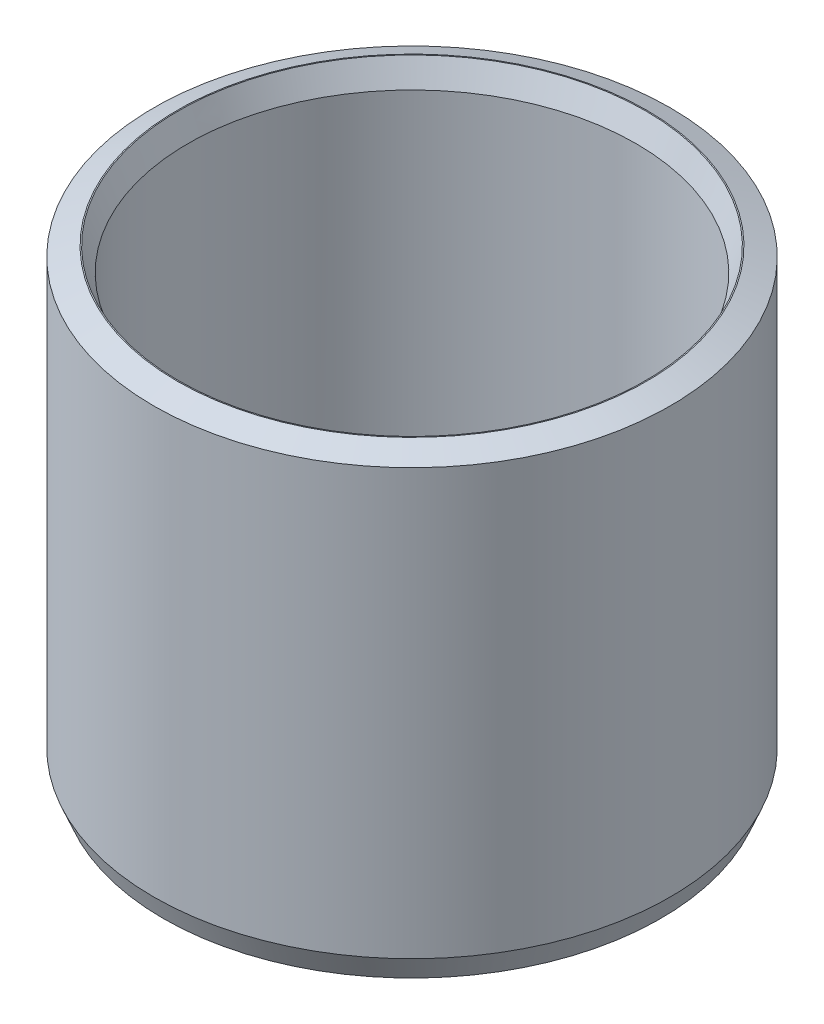
ISO-10303-21;
HEADER;
FILE_DESCRIPTION(('STEP AP214'),'2;1');
FILE_NAME('part.step','',(''),(''),'','','');
FILE_SCHEMA(('AUTOMOTIVE_DESIGN { 1 0 10303 214 1 1 1 1 }'));
ENDSEC;
DATA;
#1=APPLICATION_CONTEXT('core data for automotive mechanical design processes');
#2=APPLICATION_PROTOCOL_DEFINITION('international standard','automotive_design',2000,#1);
#3=PRODUCT_CONTEXT('',#1,'mechanical');
#4=PRODUCT('Part','Part','',(#3));
#5=PRODUCT_RELATED_PRODUCT_CATEGORY('part','',(#4));
#6=PRODUCT_DEFINITION_FORMATION('','',#4);
#7=PRODUCT_DEFINITION_CONTEXT('part definition',#1,'design');
#8=PRODUCT_DEFINITION('design','',#6,#7);
#9=PRODUCT_DEFINITION_SHAPE('','',#8);
#10=(LENGTH_UNIT() NAMED_UNIT(*) SI_UNIT(.MILLI.,.METRE.));
#11=(NAMED_UNIT(*) PLANE_ANGLE_UNIT() SI_UNIT($,.RADIAN.));
#12=(NAMED_UNIT(*) SI_UNIT($,.STERADIAN.) SOLID_ANGLE_UNIT());
#13=UNCERTAINTY_MEASURE_WITH_UNIT(LENGTH_MEASURE(1.E-05),#10,'distance_accuracy_value','');
#14=(GEOMETRIC_REPRESENTATION_CONTEXT(3) GLOBAL_UNCERTAINTY_ASSIGNED_CONTEXT((#13)) GLOBAL_UNIT_ASSIGNED_CONTEXT((#10,
#11,#12)) REPRESENTATION_CONTEXT('',''));
#15=CARTESIAN_POINT('',(0.,0.,0.));
#16=DIRECTION('',(0.,0.,1.));
#17=DIRECTION('',(1.,0.,0.));
#18=AXIS2_PLACEMENT_3D('',#15,#16,#17);
#19=CARTESIAN_POINT('',(0.,75.435899167172,0.));
#20=DIRECTION('',(0.,-1.,0.));
#21=DIRECTION('',(0.,0.,-1.));
#22=AXIS2_PLACEMENT_3D('',#19,#20,#21);
#23=CYLINDRICAL_SURFACE('',#22,42.5);
#24=CARTESIAN_POINT('',(0.,3.86957310814552,0.));
#25=DIRECTION('',(0.,1.,0.));
#26=DIRECTION('',(0.,0.,1.));
#27=AXIS2_PLACEMENT_3D('',#24,#25,#26);
#28=CIRCLE('',#27,42.5);
#29=CARTESIAN_POINT('',(0.,3.86957310814551,-42.5));
#30=VERTEX_POINT('',#29);
#31=EDGE_CURVE('E10',#30,#30,#28,.T.);
#32=CARTESIAN_POINT('',(0.,73.8527801951656,0.));
#33=DIRECTION('',(0.,1.,0.));
#34=DIRECTION('',(0.,0.,1.));
#35=AXIS2_PLACEMENT_3D('',#32,#33,#34);
#36=CIRCLE('',#35,42.5);
#37=CARTESIAN_POINT('',(0.,73.8527801951656,-42.5));
#38=VERTEX_POINT('',#37);
#39=EDGE_CURVE('E50',#38,#38,#36,.F.);
#40=CARTESIAN_POINT('',(0.,3.86957310814551,-42.5));
#41=CARTESIAN_POINT('',(0.,4.5985648486353,-42.5));
#42=CARTESIAN_POINT('',(0.,5.32755658912509,-42.5));
#43=CARTESIAN_POINT('',(0.,6.78554007010468,-42.5));
#44=CARTESIAN_POINT('',(0.,7.51453181059447,-42.5));
#45=CARTESIAN_POINT('',(0.,8.97251529157406,-42.5));
#46=CARTESIAN_POINT('',(0.,9.70150703206385,-42.5));
#47=CARTESIAN_POINT('',(0.,11.1594905130434,-42.5));
#48=CARTESIAN_POINT('',(0.,11.8884822535332,-42.5));
#49=CARTESIAN_POINT('',(0.,13.3464657345128,-42.5));
#50=CARTESIAN_POINT('',(0.,14.0754574750026,-42.5));
#51=CARTESIAN_POINT('',(0.,15.5334409559822,-42.5));
#52=CARTESIAN_POINT('',(0.,16.262432696472,-42.5));
#53=CARTESIAN_POINT('',(0.,17.7204161774516,-42.5));
#54=CARTESIAN_POINT('',(0.,18.4494079179414,-42.5));
#55=CARTESIAN_POINT('',(0.,19.907391398921,-42.5));
#56=CARTESIAN_POINT('',(0.,20.6363831394107,-42.5));
#57=CARTESIAN_POINT('',(0.,22.0943666203903,-42.5));
#58=CARTESIAN_POINT('',(0.,22.8233583608801,-42.5));
#59=CARTESIAN_POINT('',(0.,24.2813418418597,-42.5));
#60=CARTESIAN_POINT('',(0.,25.0103335823495,-42.5));
#61=CARTESIAN_POINT('',(0.,26.4683170633291,-42.5));
#62=CARTESIAN_POINT('',(0.,27.1973088038189,-42.5));
#63=CARTESIAN_POINT('',(0.,28.6552922847985,-42.5));
#64=CARTESIAN_POINT('',(0.,29.3842840252883,-42.5));
#65=CARTESIAN_POINT('',(0.,30.8422675062678,-42.5));
#66=CARTESIAN_POINT('',(0.,31.5712592467576,-42.5));
#67=CARTESIAN_POINT('',(0.,33.0292427277372,-42.5));
#68=CARTESIAN_POINT('',(0.,33.758234468227,-42.5));
#69=CARTESIAN_POINT('',(0.,35.2162179492066,-42.5));
#70=CARTESIAN_POINT('',(0.,35.9452096896964,-42.5));
#71=CARTESIAN_POINT('',(0.,37.403193170676,-42.5));
#72=CARTESIAN_POINT('',(0.,38.1321849111658,-42.5));
#73=CARTESIAN_POINT('',(0.,39.5901683921454,-42.5));
#74=CARTESIAN_POINT('',(0.,40.3191601326352,-42.5));
#75=CARTESIAN_POINT('',(0.,41.7771436136147,-42.5));
#76=CARTESIAN_POINT('',(0.,42.5061353541045,-42.5));
#77=CARTESIAN_POINT('',(0.,43.9641188350841,-42.5));
#78=CARTESIAN_POINT('',(0.,44.6931105755739,-42.5));
#79=CARTESIAN_POINT('',(0.,46.1510940565535,-42.5));
#80=CARTESIAN_POINT('',(0.,46.8800857970433,-42.5));
#81=CARTESIAN_POINT('',(0.,48.3380692780229,-42.5));
#82=CARTESIAN_POINT('',(0.,49.0670610185127,-42.5));
#83=CARTESIAN_POINT('',(0.,50.5250444994923,-42.5));
#84=CARTESIAN_POINT('',(0.,51.254036239982,-42.5));
#85=CARTESIAN_POINT('',(0.,52.7120197209616,-42.5));
#86=CARTESIAN_POINT('',(0.,53.4410114614514,-42.5));
#87=CARTESIAN_POINT('',(0.,54.898994942431,-42.5));
#88=CARTESIAN_POINT('',(0.,55.6279866829208,-42.5));
#89=CARTESIAN_POINT('',(0.,57.0859701639004,-42.5));
#90=CARTESIAN_POINT('',(0.,57.8149619043902,-42.5));
#91=CARTESIAN_POINT('',(0.,59.2729453853698,-42.5));
#92=CARTESIAN_POINT('',(0.,60.0019371258596,-42.5));
#93=CARTESIAN_POINT('',(0.,61.4599206068391,-42.5));
#94=CARTESIAN_POINT('',(0.,62.1889123473289,-42.5));
#95=CARTESIAN_POINT('',(0.,63.6468958283085,-42.5));
#96=CARTESIAN_POINT('',(0.,64.3758875687983,-42.5));
#97=CARTESIAN_POINT('',(0.,65.8338710497779,-42.5));
#98=CARTESIAN_POINT('',(0.,66.5628627902677,-42.5));
#99=CARTESIAN_POINT('',(0.,68.0208462712473,-42.5));
#100=CARTESIAN_POINT('',(0.,68.7498380117371,-42.5));
#101=CARTESIAN_POINT('',(0.,70.2078214927167,-42.5));
#102=CARTESIAN_POINT('',(0.,70.9368132332065,-42.5));
#103=CARTESIAN_POINT('',(0.,72.394796714186,-42.5));
#104=CARTESIAN_POINT('',(0.,73.1237884546758,-42.5));
#105=CARTESIAN_POINT('',(0.,73.8527801951656,-42.5));
#106=B_SPLINE_CURVE_WITH_KNOTS('',3,(#40,#41,#42,#43,#44,#45,#46,#47,#48,#49,#50,#51,#52,#53,
#54,#55,#56,#57,#58,#59,#60,#61,#62,#63,#64,#65,#66,#67,#68,#69,#70,#71,#72,#73,#74,#75,#76,#77,
#78,#79,#80,#81,#82,#83,#84,#85,#86,#87,#88,#89,#90,#91,#92,#93,#94,#95,#96,#97,#98,#99,#100,
#101,#102,#103,#104,#105),.UNSPECIFIED.,.F.,.F.,(4,2,2,2,2,2,2,2,2,2,2,2,2,2,2,2,2,2,2,2,2,2,2,
2,2,2,2,2,2,2,2,2,4),(0.,2.18697522146938,4.37395044293876,6.56092566440813,8.74790088587751,
10.9348761073469,13.1218513288163,15.3088265502856,17.495801771755,19.6827769932244,
21.8697522146938,24.0567274361632,26.2437026576325,28.4306778791019,30.6176531005713,
32.8046283220407,34.9916035435101,37.1785787649794,39.3655539864488,41.5525292079182,
43.7395044293876,45.926479650857,48.1134548723263,50.3004300937957,52.4874053152651,
54.6743805367345,56.8613557582038,59.0483309796732,61.2353062011426,63.422281422612,
65.6092566440814,67.7962318655507,69.9832070870201),.UNSPECIFIED.);
#107=EDGE_CURVE('BSEAM39',#30,#38,#106,.T.);
#108=ORIENTED_EDGE('',*,*,#31,.T.);
#109=ORIENTED_EDGE('',*,*,#39,.T.);
#110=ORIENTED_EDGE('',*,*,#107,.T.);
#111=ORIENTED_EDGE('',*,*,#107,.F.);
#112=EDGE_LOOP('',(#108,#110,#109,#111));
#113=FACE_BOUND('',#112,.T.);
#114=ADVANCED_FACE('F39',(#113),#23,.T.);
#115=CARTESIAN_POINT('',(0.,75.435899167172,0.));
#116=DIRECTION('',(0.,1.,0.));
#117=DIRECTION('',(0.,0.,1.));
#118=AXIS2_PLACEMENT_3D('',#115,#116,#117);
#119=PLANE('',#118);
#120=CARTESIAN_POINT('',(0.,75.435899167172,0.));
#121=DIRECTION('',(0.,1.,0.));
#122=DIRECTION('',(0.,0.,1.));
#123=AXIS2_PLACEMENT_3D('',#120,#121,#122);
#124=CIRCLE('',#123,38.4486086330659);
#125=CARTESIAN_POINT('',(0.,75.435899167172,38.4486086330659));
#126=VERTEX_POINT('',#125);
#127=EDGE_CURVE('E58',#126,#126,#124,.F.);
#128=ORIENTED_EDGE('',*,*,#127,.T.);
#129=EDGE_LOOP('',(#128));
#130=FACE_BOUND('',#129,.T.);
#131=CARTESIAN_POINT('',(0.,75.435899167172,0.));
#132=DIRECTION('',(0.,1.,0.));
#133=DIRECTION('',(0.,0.,1.));
#134=AXIS2_PLACEMENT_3D('',#131,#132,#133);
#135=CIRCLE('',#134,38.630426891855);
#136=CARTESIAN_POINT('',(0.,75.435899167172,-38.630426891855));
#137=VERTEX_POINT('',#136);
#138=EDGE_CURVE('E61',#137,#137,#135,.T.);
#139=ORIENTED_EDGE('',*,*,#138,.T.);
#140=EDGE_LOOP('',(#139));
#141=FACE_BOUND('',#140,.T.);
#142=ADVANCED_FACE('F88',(#130,#141),#119,.T.);
#143=CARTESIAN_POINT('',(0.,0.,0.));
#144=DIRECTION('',(0.,1.,0.));
#145=DIRECTION('',(0.,0.,1.));
#146=AXIS2_PLACEMENT_3D('',#143,#144,#145);
#147=PLANE('',#146);
#148=CARTESIAN_POINT('',(0.,0.,0.));
#149=DIRECTION('',(0.,1.,0.));
#150=DIRECTION('',(0.,0.,1.));
#151=AXIS2_PLACEMENT_3D('',#148,#149,#150);
#152=CIRCLE('',#151,40.7350627692043);
#153=CARTESIAN_POINT('',(0.,0.,-40.7350627692043));
#154=VERTEX_POINT('',#153);
#155=EDGE_CURVE('E51',#154,#154,#152,.T.);
#156=ORIENTED_EDGE('',*,*,#155,.T.);
#157=EDGE_LOOP('',(#156));
#158=FACE_BOUND('',#157,.T.);
#159=CARTESIAN_POINT('',(0.,0.,0.));
#160=DIRECTION('',(0.,1.,0.));
#161=DIRECTION('',(0.,0.,1.));
#162=AXIS2_PLACEMENT_3D('',#159,#160,#161);
#163=CIRCLE('',#162,40.9168810279934);
#164=CARTESIAN_POINT('',(0.,0.,40.9168810279934));
#165=VERTEX_POINT('',#164);
#166=EDGE_CURVE('E54',#165,#165,#163,.F.);
#167=ORIENTED_EDGE('',*,*,#166,.T.);
#168=EDGE_LOOP('',(#167));
#169=FACE_BOUND('',#168,.T.);
#170=ADVANCED_FACE('F83',(#158,#169),#147,.F.);
#171=CARTESIAN_POINT('',(0.,75.435899167172,0.));
#172=DIRECTION('',(0.,-1.,0.));
#173=DIRECTION('',(0.,0.,-1.));
#174=AXIS2_PLACEMENT_3D('',#171,#172,#173);
#175=CYLINDRICAL_SURFACE('',#174,36.8654896610593);
#176=CARTESIAN_POINT('',(0.,71.5663260590266,0.));
#177=DIRECTION('',(0.,1.,0.));
#178=DIRECTION('',(0.,0.,1.));
#179=AXIS2_PLACEMENT_3D('',#176,#177,#178);
#180=CIRCLE('',#179,36.8654896610593);
#181=CARTESIAN_POINT('',(0.,71.5663260590266,-36.8654896610593));
#182=VERTEX_POINT('',#181);
#183=EDGE_CURVE('E67',#182,#182,#180,.T.);
#184=CARTESIAN_POINT('',(0.,1.58311897200641,0.));
#185=DIRECTION('',(0.,1.,0.));
#186=DIRECTION('',(0.,0.,1.));
#187=AXIS2_PLACEMENT_3D('',#184,#185,#186);
#188=CIRCLE('',#187,36.8654896610593);
#189=CARTESIAN_POINT('',(0.,1.58311897200641,-36.8654896610593));
#190=VERTEX_POINT('',#189);
#191=EDGE_CURVE('E69',#190,#190,#188,.F.);
#192=CARTESIAN_POINT('',(0.,71.5663260590266,-36.8654896610593));
#193=CARTESIAN_POINT('',(0.,70.8373343185368,-36.8654896610593));
#194=CARTESIAN_POINT('',(0.,70.108342578047,-36.8654896610593));
#195=CARTESIAN_POINT('',(0.,68.6503590970674,-36.8654896610593));
#196=CARTESIAN_POINT('',(0.,67.9213673565776,-36.8654896610593));
#197=CARTESIAN_POINT('',(0.,66.463383875598,-36.8654896610593));
#198=CARTESIAN_POINT('',(0.,65.7343921351083,-36.8654896610593));
#199=CARTESIAN_POINT('',(0.,64.2764086541287,-36.8654896610593));
#200=CARTESIAN_POINT('',(0.,63.5474169136389,-36.8654896610593));
#201=CARTESIAN_POINT('',(0.,62.0894334326593,-36.8654896610593));
#202=CARTESIAN_POINT('',(0.,61.3604416921695,-36.8654896610593));
#203=CARTESIAN_POINT('',(0.,59.9024582111899,-36.8654896610593));
#204=CARTESIAN_POINT('',(0.,59.1734664707001,-36.8654896610593));
#205=CARTESIAN_POINT('',(0.,57.7154829897205,-36.8654896610593));
#206=CARTESIAN_POINT('',(0.,56.9864912492307,-36.8654896610593));
#207=CARTESIAN_POINT('',(0.,55.5285077682511,-36.8654896610593));
#208=CARTESIAN_POINT('',(0.,54.7995160277613,-36.8654896610593));
#209=CARTESIAN_POINT('',(0.,53.3415325467818,-36.8654896610593));
#210=CARTESIAN_POINT('',(0.,52.612540806292,-36.8654896610593));
#211=CARTESIAN_POINT('',(0.,51.1545573253124,-36.8654896610593));
#212=CARTESIAN_POINT('',(0.,50.4255655848226,-36.8654896610593));
#213=CARTESIAN_POINT('',(0.,48.967582103843,-36.8654896610593));
#214=CARTESIAN_POINT('',(0.,48.2385903633532,-36.8654896610593));
#215=CARTESIAN_POINT('',(0.,46.7806068823736,-36.8654896610593));
#216=CARTESIAN_POINT('',(0.,46.0516151418838,-36.8654896610593));
#217=CARTESIAN_POINT('',(0.,44.5936316609042,-36.8654896610593));
#218=CARTESIAN_POINT('',(0.,43.8646399204144,-36.8654896610593));
#219=CARTESIAN_POINT('',(0.,42.4066564394349,-36.8654896610593));
#220=CARTESIAN_POINT('',(0.,41.6776646989451,-36.8654896610593));
#221=CARTESIAN_POINT('',(0.,40.2196812179655,-36.8654896610593));
#222=CARTESIAN_POINT('',(0.,39.4906894774757,-36.8654896610593));
#223=CARTESIAN_POINT('',(0.,38.0327059964961,-36.8654896610593));
#224=CARTESIAN_POINT('',(0.,37.3037142560063,-36.8654896610593));
#225=CARTESIAN_POINT('',(0.,35.8457307750267,-36.8654896610593));
#226=CARTESIAN_POINT('',(0.,35.1167390345369,-36.8654896610593));
#227=CARTESIAN_POINT('',(0.,33.6587555535573,-36.8654896610593));
#228=CARTESIAN_POINT('',(0.,32.9297638130675,-36.8654896610593));
#229=CARTESIAN_POINT('',(0.,31.471780332088,-36.8654896610593));
#230=CARTESIAN_POINT('',(0.,30.7427885915982,-36.8654896610593));
#231=CARTESIAN_POINT('',(0.,29.2848051106186,-36.8654896610593));
#232=CARTESIAN_POINT('',(0.,28.5558133701288,-36.8654896610593));
#233=CARTESIAN_POINT('',(0.,27.0978298891492,-36.8654896610593));
#234=CARTESIAN_POINT('',(0.,26.3688381486594,-36.8654896610593));
#235=CARTESIAN_POINT('',(0.,24.9108546676798,-36.8654896610593));
#236=CARTESIAN_POINT('',(0.,24.18186292719,-36.8654896610593));
#237=CARTESIAN_POINT('',(0.,22.7238794462104,-36.8654896610593));
#238=CARTESIAN_POINT('',(0.,21.9948877057206,-36.8654896610593));
#239=CARTESIAN_POINT('',(0.,20.536904224741,-36.8654896610593));
#240=CARTESIAN_POINT('',(0.,19.8079124842513,-36.8654896610593));
#241=CARTESIAN_POINT('',(0.,18.3499290032717,-36.8654896610593));
#242=CARTESIAN_POINT('',(0.,17.6209372627819,-36.8654896610593));
#243=CARTESIAN_POINT('',(0.,16.1629537818023,-36.8654896610593));
#244=CARTESIAN_POINT('',(0.,15.4339620413125,-36.8654896610593));
#245=CARTESIAN_POINT('',(0.,13.9759785603329,-36.8654896610593));
#246=CARTESIAN_POINT('',(0.,13.2469868198431,-36.8654896610593));
#247=CARTESIAN_POINT('',(0.,11.7890033388635,-36.8654896610593));
#248=CARTESIAN_POINT('',(0.,11.0600115983737,-36.8654896610593));
#249=CARTESIAN_POINT('',(0.,9.60202811739415,-36.8654896610593));
#250=CARTESIAN_POINT('',(0.,8.87303637690436,-36.8654896610593));
#251=CARTESIAN_POINT('',(0.,7.41505289592477,-36.8654896610593));
#252=CARTESIAN_POINT('',(0.,6.68606115543497,-36.8654896610593));
#253=CARTESIAN_POINT('',(0.,5.22807767445538,-36.8654896610593));
#254=CARTESIAN_POINT('',(0.,4.49908593396558,-36.8654896610593));
#255=CARTESIAN_POINT('',(0.,3.041102452986,-36.8654896610593));
#256=CARTESIAN_POINT('',(0.,2.31211071249621,-36.8654896610593));
#257=CARTESIAN_POINT('',(0.,1.58311897200641,-36.8654896610593));
#258=B_SPLINE_CURVE_WITH_KNOTS('',3,(#192,#193,#194,#195,#196,#197,#198,#199,#200,#201,#202,
#203,#204,#205,#206,#207,#208,#209,#210,#211,#212,#213,#214,#215,#216,#217,#218,#219,#220,#221,
#222,#223,#224,#225,#226,#227,#228,#229,#230,#231,#232,#233,#234,#235,#236,#237,#238,#239,#240,
#241,#242,#243,#244,#245,#246,#247,#248,#249,#250,#251,#252,#253,#254,#255,#256,#257),
.UNSPECIFIED.,.F.,.F.,(4,2,2,2,2,2,2,2,2,2,2,2,2,2,2,2,2,2,2,2,2,2,2,2,2,2,2,2,2,2,2,2,4),(0.,
2.18697522146938,4.37395044293876,6.56092566440813,8.74790088587751,10.9348761073469,
13.1218513288163,15.3088265502857,17.495801771755,19.6827769932244,21.8697522146938,
24.0567274361632,26.2437026576326,28.4306778791019,30.6176531005713,32.8046283220407,
34.9916035435101,37.1785787649795,39.3655539864488,41.5525292079182,43.7395044293876,
45.926479650857,48.1134548723264,50.3004300937957,52.4874053152651,54.6743805367345,
56.8613557582039,59.0483309796733,61.2353062011426,63.422281422612,65.6092566440814,
67.7962318655508,69.9832070870202),.UNSPECIFIED.);
#259=EDGE_CURVE('BSEAM71',#182,#190,#258,.T.);
#260=ORIENTED_EDGE('',*,*,#183,.T.);
#261=ORIENTED_EDGE('',*,*,#191,.T.);
#262=ORIENTED_EDGE('',*,*,#259,.T.);
#263=ORIENTED_EDGE('',*,*,#259,.F.);
#264=EDGE_LOOP('',(#260,#262,#261,#263));
#265=FACE_BOUND('',#264,.T.);
#266=ADVANCED_FACE('F71',(#265),#175,.F.);
#267=CARTESIAN_POINT('',(0.,71.5663260590266,0.));
#268=DIRECTION('',(0.,1.,0.));
#269=DIRECTION('',(0.,0.,1.));
#270=AXIS2_PLACEMENT_3D('',#267,#268,#269);
#271=CONICAL_SURFACE('',#270,36.8654896610593,0.388343466044508);
#272=ORIENTED_EDGE('',*,*,#127,.F.);
#273=EDGE_LOOP('',(#272));
#274=FACE_BOUND('',#273,.T.);
#275=ORIENTED_EDGE('',*,*,#183,.F.);
#276=EDGE_LOOP('',(#275));
#277=FACE_BOUND('',#276,.T.);
#278=ADVANCED_FACE('F77',(#274,#277),#271,.F.);
#279=CARTESIAN_POINT('',(0.,0.,0.));
#280=DIRECTION('',(0.,-1.,0.));
#281=DIRECTION('',(0.,0.,-1.));
#282=AXIS2_PLACEMENT_3D('',#279,#280,#281);
#283=CONICAL_SURFACE('',#282,40.7350627692043,1.18245286075039);
#284=CARTESIAN_POINT('',(0.,1.58311897200641,-36.8654896610593));
#285=CARTESIAN_POINT('',(0.,1.56662814938135,-36.9057977142691));
#286=CARTESIAN_POINT('',(0.,1.55013732675628,-36.946105767479));
#287=CARTESIAN_POINT('',(0.,1.51715568150615,-37.0267218738986));
#288=CARTESIAN_POINT('',(0.,1.50066485888108,-37.0670299271085));
#289=CARTESIAN_POINT('',(0.,1.46768321363095,-37.1476460335282));
#290=CARTESIAN_POINT('',(0.,1.45119239100588,-37.187954086738));
#291=CARTESIAN_POINT('',(0.,1.41821074575575,-37.2685701931577));
#292=CARTESIAN_POINT('',(0.,1.40171992313068,-37.3088782463676));
#293=CARTESIAN_POINT('',(0.,1.36873827788055,-37.3894943527872));
#294=CARTESIAN_POINT('',(0.,1.35224745525548,-37.4298024059971));
#295=CARTESIAN_POINT('',(0.,1.31926581000534,-37.5104185124168));
#296=CARTESIAN_POINT('',(0.,1.30277498738028,-37.5507265656266));
#297=CARTESIAN_POINT('',(0.,1.26979334213014,-37.6313426720463));
#298=CARTESIAN_POINT('',(0.,1.25330251950508,-37.6716507252562));
#299=CARTESIAN_POINT('',(0.,1.22032087425494,-37.7522668316758));
#300=CARTESIAN_POINT('',(0.,1.20383005162988,-37.7925748848857));
#301=CARTESIAN_POINT('',(0.,1.17084840637974,-37.8731909913054));
#302=CARTESIAN_POINT('',(0.,1.15435758375468,-37.9134990445152));
#303=CARTESIAN_POINT('',(0.,1.12137593850454,-37.9941151509349));
#304=CARTESIAN_POINT('',(0.,1.10488511587948,-38.0344232041448));
#305=CARTESIAN_POINT('',(0.,1.07190347062934,-38.1150393105644));
#306=CARTESIAN_POINT('',(0.,1.05541264800428,-38.1553473637743));
#307=CARTESIAN_POINT('',(0.,1.02243100275414,-38.235963470194));
#308=CARTESIAN_POINT('',(0.,1.00594018012908,-38.2762715234038));
#309=CARTESIAN_POINT('',(0.,0.972958534878942,-38.3568876298235));
#310=CARTESIAN_POINT('',(0.,0.956467712253875,-38.3971956830334));
#311=CARTESIAN_POINT('',(0.,0.923486067003742,-38.477811789453));
#312=CARTESIAN_POINT('',(0.,0.906995244378675,-38.5181198426629));
#313=CARTESIAN_POINT('',(0.,0.874013599128541,-38.5987359490826));
#314=CARTESIAN_POINT('',(0.,0.857522776503474,-38.6390440022924));
#315=CARTESIAN_POINT('',(0.,0.824541131253341,-38.7196601087121));
#316=CARTESIAN_POINT('',(0.,0.808050308628274,-38.759968161922));
#317=CARTESIAN_POINT('',(0.,0.77506866337814,-38.8405842683416));
#318=CARTESIAN_POINT('',(0.,0.758577840753073,-38.8808923215515));
#319=CARTESIAN_POINT('',(0.,0.72559619550294,-38.9615084279712));
#320=CARTESIAN_POINT('',(0.,0.709105372877873,-39.001816481181));
#321=CARTESIAN_POINT('',(0.,0.676123727627739,-39.0824325876007));
#322=CARTESIAN_POINT('',(0.,0.659632905002672,-39.1227406408106));
#323=CARTESIAN_POINT('',(0.,0.626651259752539,-39.2033567472302));
#324=CARTESIAN_POINT('',(0.,0.610160437127472,-39.2436648004401));
#325=CARTESIAN_POINT('',(0.,0.577178791877338,-39.3242809068598));
#326=CARTESIAN_POINT('',(0.,0.560687969252272,-39.3645889600696));
#327=CARTESIAN_POINT('',(0.,0.527706324002138,-39.4452050664893));
#328=CARTESIAN_POINT('',(0.,0.511215501377071,-39.4855131196992));
#329=CARTESIAN_POINT('',(0.,0.478233856126937,-39.5661292261188));
#330=CARTESIAN_POINT('',(0.,0.46174303350187,-39.6064372793287));
#331=CARTESIAN_POINT('',(0.,0.428761388251737,-39.6870533857484));
#332=CARTESIAN_POINT('',(0.,0.412270565626671,-39.7273614389582));
#333=CARTESIAN_POINT('',(0.,0.379288920376537,-39.8079775453779));
#334=CARTESIAN_POINT('',(0.,0.36279809775147,-39.8482855985878));
#335=CARTESIAN_POINT('',(0.,0.329816452501336,-39.9289017050074));
#336=CARTESIAN_POINT('',(0.,0.313325629876269,-39.9692097582173));
#337=CARTESIAN_POINT('',(0.,0.280343984626136,-40.049825864637));
#338=CARTESIAN_POINT('',(0.,0.263853162001069,-40.0901339178468));
#339=CARTESIAN_POINT('',(0.,0.230871516750935,-40.1707500242665));
#340=CARTESIAN_POINT('',(0.,0.214380694125869,-40.2110580774764));
#341=CARTESIAN_POINT('',(0.,0.181399048875735,-40.291674183896));
#342=CARTESIAN_POINT('',(0.,0.164908226250668,-40.3319822371059));
#343=CARTESIAN_POINT('',(0.,0.131926581000535,-40.4125983435256));
#344=CARTESIAN_POINT('',(0.,0.115435758375468,-40.4529063967354));
#345=CARTESIAN_POINT('',(0.,0.0824541131253341,-40.5335225031551));
#346=CARTESIAN_POINT('',(0.,0.0659632905002673,-40.573830556365));
#347=CARTESIAN_POINT('',(0.,0.0329816452501336,-40.6544466627847));
#348=CARTESIAN_POINT('',(0.,0.0164908226250668,-40.6947547159945));
#349=CARTESIAN_POINT('',(0.,0.,-40.7350627692043));
#350=B_SPLINE_CURVE_WITH_KNOTS('',3,(#284,#285,#286,#287,#288,#289,#290,#291,#292,#293,#294,
#295,#296,#297,#298,#299,#300,#301,#302,#303,#304,#305,#306,#307,#308,#309,#310,#311,#312,#313,
#314,#315,#316,#317,#318,#319,#320,#321,#322,#323,#324,#325,#326,#327,#328,#329,#330,#331,#332,
#333,#334,#335,#336,#337,#338,#339,#340,#341,#342,#343,#344,#345,#346,#347,#348,#349),
.UNSPECIFIED.,.F.,.F.,(4,2,2,2,2,2,2,2,2,2,2,2,2,2,2,2,2,2,2,2,2,2,2,2,2,2,2,2,2,2,2,2,4),(0.,
0.130652889213257,0.261305778426514,0.391958667639771,0.522611556853028,0.653264446066284,
0.783917335279541,0.914570224492805,1.04522311370606,1.17587600291932,1.30652889213258,
1.43718178134583,1.56783467055909,1.69848755977235,1.8291404489856,1.95979333819886,
2.09044622741212,2.22109911662537,2.35175200583863,2.48240489505189,2.61305778426514,
2.7437106734784,2.87436356269166,3.00501645190492,3.13566934111818,3.26632223033144,
3.39697511954469,3.52762800875795,3.65828089797121,3.78893378718446,3.91958667639772,
4.05023956561098,4.18089245482424),.UNSPECIFIED.);
#351=EDGE_CURVE('BSEAM73',#190,#154,#350,.T.);
#352=ORIENTED_EDGE('',*,*,#191,.F.);
#353=ORIENTED_EDGE('',*,*,#155,.F.);
#354=ORIENTED_EDGE('',*,*,#351,.T.);
#355=ORIENTED_EDGE('',*,*,#351,.F.);
#356=EDGE_LOOP('',(#352,#354,#353,#355));
#357=FACE_BOUND('',#356,.T.);
#358=ADVANCED_FACE('F73',(#357),#283,.F.);
#359=CARTESIAN_POINT('',(0.,3.86957310814551,0.));
#360=DIRECTION('',(0.,1.,0.));
#361=DIRECTION('',(0.,0.,1.));
#362=AXIS2_PLACEMENT_3D('',#359,#360,#361);
#363=CONICAL_SURFACE('',#362,42.5,0.388343466044514);
#364=ORIENTED_EDGE('',*,*,#166,.F.);
#365=EDGE_LOOP('',(#364));
#366=FACE_BOUND('',#365,.T.);
#367=ORIENTED_EDGE('',*,*,#31,.F.);
#368=EDGE_LOOP('',(#367));
#369=FACE_BOUND('',#368,.T.);
#370=ADVANCED_FACE('F76',(#366,#369),#363,.T.);
#371=CARTESIAN_POINT('',(0.,75.435899167172,0.));
#372=DIRECTION('',(0.,-1.,0.));
#373=DIRECTION('',(0.,0.,-1.));
#374=AXIS2_PLACEMENT_3D('',#371,#372,#373);
#375=CONICAL_SURFACE('',#374,38.630426891855,1.18245286075038);
#376=CARTESIAN_POINT('',(0.,73.8527801951656,-42.5));
#377=CARTESIAN_POINT('',(0.,73.8692710177907,-42.4596919467902));
#378=CARTESIAN_POINT('',(0.,73.8857618404158,-42.4193838935803));
#379=CARTESIAN_POINT('',(0.,73.9187434856659,-42.3387677871607));
#380=CARTESIAN_POINT('',(0.,73.935234308291,-42.2984597339508));
#381=CARTESIAN_POINT('',(0.,73.9682159535411,-42.2178436275311));
#382=CARTESIAN_POINT('',(0.,73.9847067761662,-42.1775355743213));
#383=CARTESIAN_POINT('',(0.,74.0176884214163,-42.0969194679016));
#384=CARTESIAN_POINT('',(0.,74.0341792440414,-42.0566114146917));
#385=CARTESIAN_POINT('',(0.,74.0671608892915,-41.9759953082721));
#386=CARTESIAN_POINT('',(0.,74.0836517119166,-41.9356872550622));
#387=CARTESIAN_POINT('',(0.,74.1166333571667,-41.8550711486425));
#388=CARTESIAN_POINT('',(0.,74.1331241797918,-41.8147630954327));
#389=CARTESIAN_POINT('',(0.,74.1661058250419,-41.734146989013));
#390=CARTESIAN_POINT('',(0.,74.182596647667,-41.6938389358032));
#391=CARTESIAN_POINT('',(0.,74.2155782929171,-41.6132228293835));
#392=CARTESIAN_POINT('',(0.,74.2320691155422,-41.5729147761736));
#393=CARTESIAN_POINT('',(0.,74.2650507607923,-41.4922986697539));
#394=CARTESIAN_POINT('',(0.,74.2815415834174,-41.4519906165441));
#395=CARTESIAN_POINT('',(0.,74.3145232286675,-41.3713745101244));
#396=CARTESIAN_POINT('',(0.,74.3310140512926,-41.3310664569146));
#397=CARTESIAN_POINT('',(0.,74.3639956965427,-41.2504503504949));
#398=CARTESIAN_POINT('',(0.,74.3804865191678,-41.210142297285));
#399=CARTESIAN_POINT('',(0.,74.4134681644179,-41.1295261908653));
#400=CARTESIAN_POINT('',(0.,74.429958987043,-41.0892181376555));
#401=CARTESIAN_POINT('',(0.,74.4629406322931,-41.0086020312358));
#402=CARTESIAN_POINT('',(0.,74.4794314549182,-40.968293978026));
#403=CARTESIAN_POINT('',(0.,74.5124131001683,-40.8876778716063));
#404=CARTESIAN_POINT('',(0.,74.5289039227934,-40.8473698183964));
#405=CARTESIAN_POINT('',(0.,74.5618855680435,-40.7667537119767));
#406=CARTESIAN_POINT('',(0.,74.5783763906686,-40.7264456587669));
#407=CARTESIAN_POINT('',(0.,74.6113580359187,-40.6458295523472));
#408=CARTESIAN_POINT('',(0.,74.6278488585438,-40.6055214991374));
#409=CARTESIAN_POINT('',(0.,74.6608305037939,-40.5249053927177));
#410=CARTESIAN_POINT('',(0.,74.677321326419,-40.4845973395078));
#411=CARTESIAN_POINT('',(0.,74.7103029716691,-40.4039812330881));
#412=CARTESIAN_POINT('',(0.,74.7267937942942,-40.3636731798783));
#413=CARTESIAN_POINT('',(0.,74.7597754395443,-40.2830570734586));
#414=CARTESIAN_POINT('',(0.,74.7762662621694,-40.2427490202488));
#415=CARTESIAN_POINT('',(0.,74.8092479074195,-40.1621329138291));
#416=CARTESIAN_POINT('',(0.,74.8257387300446,-40.1218248606192));
#417=CARTESIAN_POINT('',(0.,74.8587203752947,-40.0412087541995));
#418=CARTESIAN_POINT('',(0.,74.8752111979198,-40.0009007009897));
#419=CARTESIAN_POINT('',(0.,74.9081928431699,-39.92028459457));
#420=CARTESIAN_POINT('',(0.,74.924683665795,-39.8799765413602));
#421=CARTESIAN_POINT('',(0.,74.9576653110451,-39.7993604349405));
#422=CARTESIAN_POINT('',(0.,74.9741561336702,-39.7590523817306));
#423=CARTESIAN_POINT('',(0.,75.0071377789203,-39.678436275311));
#424=CARTESIAN_POINT('',(0.,75.0236286015454,-39.6381282221011));
#425=CARTESIAN_POINT('',(0.,75.0566102467955,-39.5575121156814));
#426=CARTESIAN_POINT('',(0.,75.0731010694206,-39.5172040624716));
#427=CARTESIAN_POINT('',(0.,75.1060827146707,-39.4365879560519));
#428=CARTESIAN_POINT('',(0.,75.1225735372958,-39.396279902842));
#429=CARTESIAN_POINT('',(0.,75.1555551825459,-39.3156637964224));
#430=CARTESIAN_POINT('',(0.,75.172046005171,-39.2753557432125));
#431=CARTESIAN_POINT('',(0.,75.2050276504211,-39.1947396367928));
#432=CARTESIAN_POINT('',(0.,75.2215184730462,-39.154431583583));
#433=CARTESIAN_POINT('',(0.,75.2545001182963,-39.0738154771633));
#434=CARTESIAN_POINT('',(0.,75.2709909409214,-39.0335074239535));
#435=CARTESIAN_POINT('',(0.,75.3039725861715,-38.9528913175338));
#436=CARTESIAN_POINT('',(0.,75.3204634087966,-38.9125832643239));
#437=CARTESIAN_POINT('',(0.,75.3534450540467,-38.8319671579042));
#438=CARTESIAN_POINT('',(0.,75.3699358766718,-38.7916591046944));
#439=CARTESIAN_POINT('',(0.,75.4029175219219,-38.7110429982747));
#440=CARTESIAN_POINT('',(0.,75.419408344547,-38.6707349450649));
#441=CARTESIAN_POINT('',(0.,75.435899167172,-38.630426891855));
#442=B_SPLINE_CURVE_WITH_KNOTS('',3,(#376,#377,#378,#379,#380,#381,#382,#383,#384,#385,#386,
#387,#388,#389,#390,#391,#392,#393,#394,#395,#396,#397,#398,#399,#400,#401,#402,#403,#404,#405,
#406,#407,#408,#409,#410,#411,#412,#413,#414,#415,#416,#417,#418,#419,#420,#421,#422,#423,#424,
#425,#426,#427,#428,#429,#430,#431,#432,#433,#434,#435,#436,#437,#438,#439,#440,#441),
.UNSPECIFIED.,.F.,.F.,(4,2,2,2,2,2,2,2,2,2,2,2,2,2,2,2,2,2,2,2,2,2,2,2,2,2,2,2,2,2,2,2,4),(0.,
0.130652889213259,0.261305778426518,0.391958667639771,0.522611556853024,0.653264446066277,
0.783917335279536,0.914570224492795,1.04522311370605,1.1758760029193,1.30652889213255,
1.43718178134581,1.56783467055907,1.69848755977233,1.82914044898558,1.95979333819883,
2.09044622741209,2.22109911662535,2.3517520058386,2.48240489505186,2.61305778426511,
2.74371067347837,2.87436356269163,3.00501645190487,3.13566934111813,3.26632223033139,
3.39697511954465,3.5276280087579,3.65828089797115,3.78893378718441,3.91958667639766,
4.05023956561092,4.18089245482418),.UNSPECIFIED.);
#443=EDGE_CURVE('BSEAM45',#38,#137,#442,.T.);
#444=ORIENTED_EDGE('',*,*,#39,.F.);
#445=ORIENTED_EDGE('',*,*,#138,.F.);
#446=ORIENTED_EDGE('',*,*,#443,.T.);
#447=ORIENTED_EDGE('',*,*,#443,.F.);
#448=EDGE_LOOP('',(#444,#446,#445,#447));
#449=FACE_BOUND('',#448,.T.);
#450=ADVANCED_FACE('F45',(#449),#375,.T.);
#451=CLOSED_SHELL('',(#114,#142,#170,#266,#278,#358,#370,#450));
#452=MANIFOLD_SOLID_BREP('B2',#451);
#453=ADVANCED_BREP_SHAPE_REPRESENTATION('',(#18,#452),#14);
#454=SHAPE_DEFINITION_REPRESENTATION(#9,#453);
ENDSEC;
END-ISO-10303-21;
